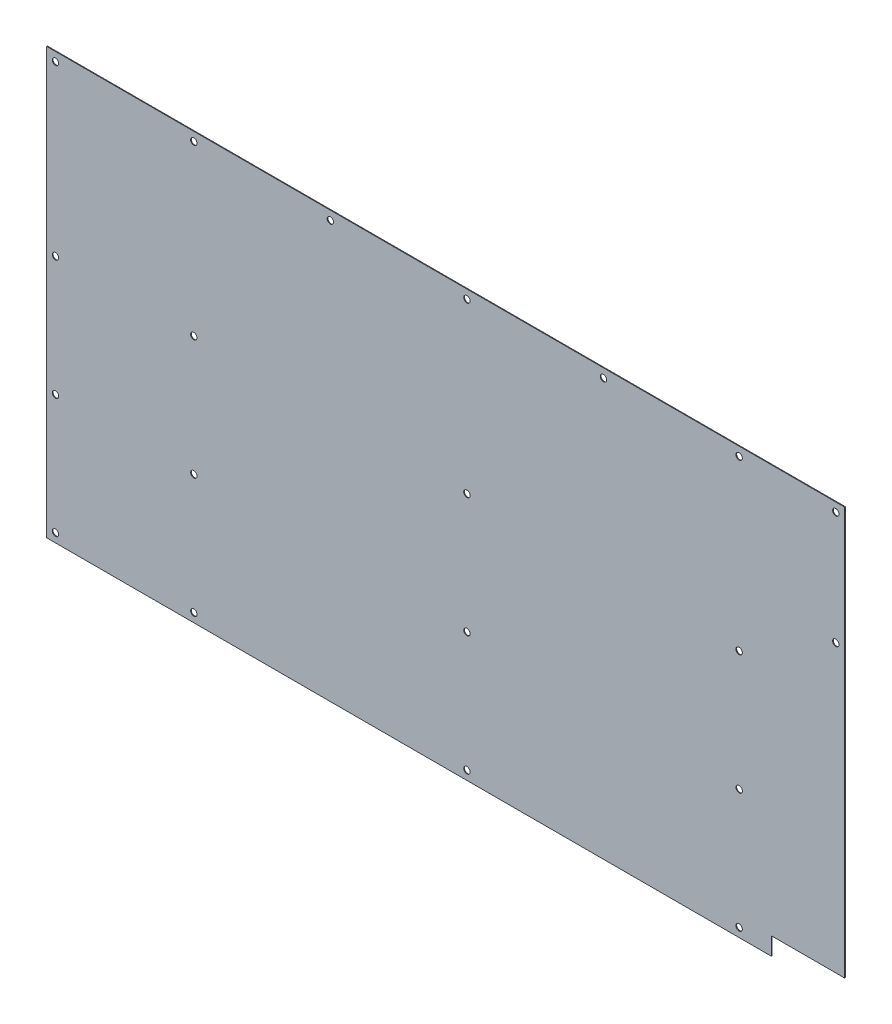
ISO-10303-21;
HEADER;
FILE_DESCRIPTION(('STEP AP214'),'2;1');
FILE_NAME('part.step','',(''),(''),'','','');
FILE_SCHEMA(('AUTOMOTIVE_DESIGN { 1 0 10303 214 1 1 1 1 }'));
ENDSEC;
DATA;
#1=APPLICATION_CONTEXT('core data for automotive mechanical design processes');
#2=APPLICATION_PROTOCOL_DEFINITION('international standard','automotive_design',2000,#1);
#3=PRODUCT_CONTEXT('',#1,'mechanical');
#4=PRODUCT('Part','Part','',(#3));
#5=PRODUCT_RELATED_PRODUCT_CATEGORY('part','',(#4));
#6=PRODUCT_DEFINITION_FORMATION('','',#4);
#7=PRODUCT_DEFINITION_CONTEXT('part definition',#1,'design');
#8=PRODUCT_DEFINITION('design','',#6,#7);
#9=PRODUCT_DEFINITION_SHAPE('','',#8);
#10=(LENGTH_UNIT() NAMED_UNIT(*) SI_UNIT(.MILLI.,.METRE.));
#11=(NAMED_UNIT(*) PLANE_ANGLE_UNIT() SI_UNIT($,.RADIAN.));
#12=(NAMED_UNIT(*) SI_UNIT($,.STERADIAN.) SOLID_ANGLE_UNIT());
#13=UNCERTAINTY_MEASURE_WITH_UNIT(LENGTH_MEASURE(1.E-05),#10,'distance_accuracy_value','');
#14=(GEOMETRIC_REPRESENTATION_CONTEXT(3) GLOBAL_UNCERTAINTY_ASSIGNED_CONTEXT((#13)) GLOBAL_UNIT_ASSIGNED_CONTEXT((#10,
#11,#12)) REPRESENTATION_CONTEXT('',''));
#15=CARTESIAN_POINT('',(0.,0.,0.));
#16=DIRECTION('',(0.,0.,1.));
#17=DIRECTION('',(1.,0.,0.));
#18=AXIS2_PLACEMENT_3D('',#15,#16,#17);
#19=CARTESIAN_POINT('',(0.,243.84,0.4064));
#20=DIRECTION('',(0.,0.,-1.));
#21=DIRECTION('',(-1.,0.,0.));
#22=AXIS2_PLACEMENT_3D('',#19,#20,#21);
#23=CYLINDRICAL_SURFACE('',#22,0.0635);
#24=CARTESIAN_POINT('',(0.,243.84,0.));
#25=DIRECTION('',(0.,0.,1.));
#26=DIRECTION('',(1.,0.,0.));
#27=AXIS2_PLACEMENT_3D('',#24,#25,#26);
#28=CIRCLE('',#27,0.0635);
#29=CARTESIAN_POINT('',(0.,243.7765,0.));
#30=VERTEX_POINT('',#29);
#31=CARTESIAN_POINT('',(0.0635,243.84,0.));
#32=VERTEX_POINT('',#31);
#33=EDGE_CURVE('E212',#30,#32,#28,.T.);
#34=ORIENTED_EDGE('',*,*,#33,.F.);
#35=DIRECTION('',(0.,0.,-1.));
#36=VECTOR('',#35,1.);
#37=CARTESIAN_POINT('',(0.,243.7765,0.4064));
#38=LINE('',#37,#36);
#39=CARTESIAN_POINT('',(0.,243.7765,0.4064));
#40=VERTEX_POINT('',#39);
#41=EDGE_CURVE('E11',#40,#30,#38,.T.);
#42=ORIENTED_EDGE('',*,*,#41,.F.);
#43=CARTESIAN_POINT('',(0.,243.84,0.4064));
#44=DIRECTION('',(0.,0.,1.));
#45=DIRECTION('',(1.,0.,0.));
#46=AXIS2_PLACEMENT_3D('',#43,#44,#45);
#47=CIRCLE('',#46,0.0635);
#48=CARTESIAN_POINT('',(0.0635,243.84,0.4064));
#49=VERTEX_POINT('',#48);
#50=EDGE_CURVE('E664',#40,#49,#47,.T.);
#51=ORIENTED_EDGE('',*,*,#50,.T.);
#52=DIRECTION('',(0.,0.,-1.));
#53=VECTOR('',#52,1.);
#54=CARTESIAN_POINT('',(0.0635,243.84,0.4064));
#55=LINE('',#54,#53);
#56=EDGE_CURVE('E99',#49,#32,#55,.T.);
#57=ORIENTED_EDGE('',*,*,#56,.T.);
#58=EDGE_LOOP('',(#34,#42,#51,#57));
#59=FACE_BOUND('',#58,.T.);
#60=ADVANCED_FACE('F39',(#59),#23,.F.);
#61=CARTESIAN_POINT('',(0.,0.,0.4064));
#62=DIRECTION('',(1.,0.,0.));
#63=DIRECTION('',(0.,0.,-1.));
#64=AXIS2_PLACEMENT_3D('',#61,#62,#63);
#65=PLANE('',#64);
#66=DIRECTION('',(0.,-1.,0.));
#67=VECTOR('',#66,1.);
#68=CARTESIAN_POINT('',(0.,0.,0.));
#69=LINE('',#68,#67);
#70=CARTESIAN_POINT('',(0.,0.,0.));
#71=VERTEX_POINT('',#70);
#72=EDGE_CURVE('E215',#30,#71,#69,.T.);
#73=ORIENTED_EDGE('',*,*,#72,.T.);
#74=DIRECTION('',(0.,0.,-1.));
#75=VECTOR('',#74,1.);
#76=CARTESIAN_POINT('',(0.,0.,0.4064));
#77=LINE('',#76,#75);
#78=CARTESIAN_POINT('',(0.,0.,0.4064));
#79=VERTEX_POINT('',#78);
#80=EDGE_CURVE('E48',#79,#71,#77,.T.);
#81=ORIENTED_EDGE('',*,*,#80,.F.);
#82=DIRECTION('',(0.,-1.,0.));
#83=VECTOR('',#82,1.);
#84=CARTESIAN_POINT('',(0.,0.,0.4064));
#85=LINE('',#84,#83);
#86=EDGE_CURVE('E656',#40,#79,#85,.T.);
#87=ORIENTED_EDGE('',*,*,#86,.F.);
#88=ORIENTED_EDGE('',*,*,#41,.T.);
#89=EDGE_LOOP('',(#73,#81,#87,#88));
#90=FACE_BOUND('',#89,.T.);
#91=ADVANCED_FACE('F266',(#90),#65,.F.);
#92=CARTESIAN_POINT('',(0.,0.,0.4064));
#93=DIRECTION('',(0.,1.,0.));
#94=DIRECTION('',(-1.,0.,0.));
#95=AXIS2_PLACEMENT_3D('',#92,#93,#94);
#96=PLANE('',#95);
#97=DIRECTION('',(1.,0.,0.));
#98=VECTOR('',#97,1.);
#99=CARTESIAN_POINT('',(0.,0.,0.));
#100=LINE('',#99,#98);
#101=CARTESIAN_POINT('',(415.2265,0.,0.));
#102=VERTEX_POINT('',#101);
#103=EDGE_CURVE('E218',#71,#102,#100,.T.);
#104=ORIENTED_EDGE('',*,*,#103,.T.);
#105=DIRECTION('',(0.,0.,-1.));
#106=VECTOR('',#105,1.);
#107=CARTESIAN_POINT('',(415.2265,0.,0.4064));
#108=LINE('',#107,#106);
#109=CARTESIAN_POINT('',(415.2265,0.,0.4064));
#110=VERTEX_POINT('',#109);
#111=EDGE_CURVE('E256',#110,#102,#108,.T.);
#112=ORIENTED_EDGE('',*,*,#111,.F.);
#113=DIRECTION('',(1.,0.,0.));
#114=VECTOR('',#113,1.);
#115=CARTESIAN_POINT('',(0.,0.,0.4064));
#116=LINE('',#115,#114);
#117=EDGE_CURVE('E262',#79,#110,#116,.T.);
#118=ORIENTED_EDGE('',*,*,#117,.F.);
#119=ORIENTED_EDGE('',*,*,#80,.T.);
#120=EDGE_LOOP('',(#104,#112,#118,#119));
#121=FACE_BOUND('',#120,.T.);
#122=ADVANCED_FACE('F260',(#121),#96,.F.);
#123=CARTESIAN_POINT('',(415.29,0.,0.4064));
#124=DIRECTION('',(0.,0.,-1.));
#125=DIRECTION('',(-1.,0.,0.));
#126=AXIS2_PLACEMENT_3D('',#123,#124,#125);
#127=CYLINDRICAL_SURFACE('',#126,0.0634999999999941);
#128=CARTESIAN_POINT('',(415.29,0.,0.));
#129=DIRECTION('',(0.,0.,1.));
#130=DIRECTION('',(1.,0.,0.));
#131=AXIS2_PLACEMENT_3D('',#128,#129,#130);
#132=CIRCLE('',#131,0.0634999999999941);
#133=CARTESIAN_POINT('',(415.29,0.0634999999999941,0.));
#134=VERTEX_POINT('',#133);
#135=EDGE_CURVE('E221',#134,#102,#132,.T.);
#136=ORIENTED_EDGE('',*,*,#135,.F.);
#137=DIRECTION('',(0.,0.,-1.));
#138=VECTOR('',#137,1.);
#139=CARTESIAN_POINT('',(415.29,0.0634999999999941,0.4064));
#140=LINE('',#139,#138);
#141=CARTESIAN_POINT('',(415.29,0.0634999999999941,0.4064));
#142=VERTEX_POINT('',#141);
#143=EDGE_CURVE('E254',#142,#134,#140,.T.);
#144=ORIENTED_EDGE('',*,*,#143,.F.);
#145=CARTESIAN_POINT('',(415.29,0.,0.4064));
#146=DIRECTION('',(0.,0.,1.));
#147=DIRECTION('',(1.,0.,0.));
#148=AXIS2_PLACEMENT_3D('',#145,#146,#147);
#149=CIRCLE('',#148,0.0634999999999941);
#150=EDGE_CURVE('E653',#142,#110,#149,.T.);
#151=ORIENTED_EDGE('',*,*,#150,.T.);
#152=ORIENTED_EDGE('',*,*,#111,.T.);
#153=EDGE_LOOP('',(#136,#144,#151,#152));
#154=FACE_BOUND('',#153,.T.);
#155=ADVANCED_FACE('F444',(#154),#127,.F.);
#156=CARTESIAN_POINT('',(415.29,0.,0.4064));
#157=DIRECTION('',(-1.,0.,0.));
#158=DIRECTION('',(0.,0.,1.));
#159=AXIS2_PLACEMENT_3D('',#156,#157,#158);
#160=PLANE('',#159);
#161=DIRECTION('',(0.,1.,0.));
#162=VECTOR('',#161,1.);
#163=CARTESIAN_POINT('',(415.29,0.,0.));
#164=LINE('',#163,#162);
#165=CARTESIAN_POINT('',(415.29,10.0965,0.));
#166=VERTEX_POINT('',#165);
#167=EDGE_CURVE('E224',#134,#166,#164,.T.);
#168=ORIENTED_EDGE('',*,*,#167,.T.);
#169=DIRECTION('',(0.,0.,-1.));
#170=VECTOR('',#169,1.);
#171=CARTESIAN_POINT('',(415.29,10.0965,0.4064));
#172=LINE('',#171,#170);
#173=CARTESIAN_POINT('',(415.29,10.0965,0.4064));
#174=VERTEX_POINT('',#173);
#175=EDGE_CURVE('E252',#174,#166,#172,.T.);
#176=ORIENTED_EDGE('',*,*,#175,.F.);
#177=DIRECTION('',(0.,1.,0.));
#178=VECTOR('',#177,1.);
#179=CARTESIAN_POINT('',(415.29,0.,0.4064));
#180=LINE('',#179,#178);
#181=EDGE_CURVE('E649',#142,#174,#180,.T.);
#182=ORIENTED_EDGE('',*,*,#181,.F.);
#183=ORIENTED_EDGE('',*,*,#143,.T.);
#184=EDGE_LOOP('',(#168,#176,#182,#183));
#185=FACE_BOUND('',#184,.T.);
#186=ADVANCED_FACE('F440',(#185),#160,.F.);
#187=CARTESIAN_POINT('',(415.29,10.16,0.4064));
#188=DIRECTION('',(0.,0.,-1.));
#189=DIRECTION('',(-1.,0.,0.));
#190=AXIS2_PLACEMENT_3D('',#187,#188,#189);
#191=CYLINDRICAL_SURFACE('',#190,0.0634999999999941);
#192=CARTESIAN_POINT('',(415.29,10.16,0.));
#193=DIRECTION('',(0.,0.,1.));
#194=DIRECTION('',(1.,0.,0.));
#195=AXIS2_PLACEMENT_3D('',#192,#193,#194);
#196=CIRCLE('',#195,0.0634999999999941);
#197=CARTESIAN_POINT('',(415.3535,10.16,0.));
#198=VERTEX_POINT('',#197);
#199=EDGE_CURVE('E227',#198,#166,#196,.T.);
#200=ORIENTED_EDGE('',*,*,#199,.F.);
#201=DIRECTION('',(0.,0.,-1.));
#202=VECTOR('',#201,1.);
#203=CARTESIAN_POINT('',(415.3535,10.16,0.4064));
#204=LINE('',#203,#202);
#205=CARTESIAN_POINT('',(415.3535,10.16,0.4064));
#206=VERTEX_POINT('',#205);
#207=EDGE_CURVE('E250',#206,#198,#204,.T.);
#208=ORIENTED_EDGE('',*,*,#207,.F.);
#209=CARTESIAN_POINT('',(415.29,10.16,0.4064));
#210=DIRECTION('',(0.,0.,1.));
#211=DIRECTION('',(1.,0.,0.));
#212=AXIS2_PLACEMENT_3D('',#209,#210,#211);
#213=CIRCLE('',#212,0.0634999999999941);
#214=EDGE_CURVE('E652',#206,#174,#213,.T.);
#215=ORIENTED_EDGE('',*,*,#214,.T.);
#216=ORIENTED_EDGE('',*,*,#175,.T.);
#217=EDGE_LOOP('',(#200,#208,#215,#216));
#218=FACE_BOUND('',#217,.T.);
#219=ADVANCED_FACE('F436',(#218),#191,.F.);
#220=CARTESIAN_POINT('',(0.,10.16,0.4064));
#221=DIRECTION('',(0.,1.,0.));
#222=DIRECTION('',(0.,0.,1.));
#223=AXIS2_PLACEMENT_3D('',#220,#221,#222);
#224=PLANE('',#223);
#225=DIRECTION('',(1.,0.,0.));
#226=VECTOR('',#225,1.);
#227=CARTESIAN_POINT('',(0.,10.16,0.));
#228=LINE('',#227,#226);
#229=CARTESIAN_POINT('',(457.1365,10.16,0.));
#230=VERTEX_POINT('',#229);
#231=EDGE_CURVE('E230',#198,#230,#228,.T.);
#232=ORIENTED_EDGE('',*,*,#231,.T.);
#233=DIRECTION('',(0.,0.,-1.));
#234=VECTOR('',#233,1.);
#235=CARTESIAN_POINT('',(457.1365,10.16,0.4064));
#236=LINE('',#235,#234);
#237=CARTESIAN_POINT('',(457.1365,10.16,0.4064));
#238=VERTEX_POINT('',#237);
#239=EDGE_CURVE('E248',#238,#230,#236,.T.);
#240=ORIENTED_EDGE('',*,*,#239,.F.);
#241=DIRECTION('',(1.,0.,0.));
#242=VECTOR('',#241,1.);
#243=CARTESIAN_POINT('',(0.,10.16,0.4064));
#244=LINE('',#243,#242);
#245=EDGE_CURVE('E661',#206,#238,#244,.T.);
#246=ORIENTED_EDGE('',*,*,#245,.F.);
#247=ORIENTED_EDGE('',*,*,#207,.T.);
#248=EDGE_LOOP('',(#232,#240,#246,#247));
#249=FACE_BOUND('',#248,.T.);
#250=ADVANCED_FACE('F432',(#249),#224,.F.);
#251=CARTESIAN_POINT('',(457.2,10.16,0.4064));
#252=DIRECTION('',(0.,0.,-1.));
#253=DIRECTION('',(-1.,0.,0.));
#254=AXIS2_PLACEMENT_3D('',#251,#252,#253);
#255=CYLINDRICAL_SURFACE('',#254,0.0634999999999941);
#256=CARTESIAN_POINT('',(457.2,10.16,0.));
#257=DIRECTION('',(0.,0.,1.));
#258=DIRECTION('',(1.,0.,0.));
#259=AXIS2_PLACEMENT_3D('',#256,#257,#258);
#260=CIRCLE('',#259,0.0634999999999941);
#261=CARTESIAN_POINT('',(457.2,10.2235,0.));
#262=VERTEX_POINT('',#261);
#263=EDGE_CURVE('E233',#262,#230,#260,.T.);
#264=ORIENTED_EDGE('',*,*,#263,.F.);
#265=DIRECTION('',(0.,0.,-1.));
#266=VECTOR('',#265,1.);
#267=CARTESIAN_POINT('',(457.2,10.2235,0.4064));
#268=LINE('',#267,#266);
#269=CARTESIAN_POINT('',(457.2,10.2235,0.4064));
#270=VERTEX_POINT('',#269);
#271=EDGE_CURVE('E145',#270,#262,#268,.T.);
#272=ORIENTED_EDGE('',*,*,#271,.F.);
#273=CARTESIAN_POINT('',(457.2,10.16,0.4064));
#274=DIRECTION('',(0.,0.,1.));
#275=DIRECTION('',(1.,0.,0.));
#276=AXIS2_PLACEMENT_3D('',#273,#274,#275);
#277=CIRCLE('',#276,0.0634999999999941);
#278=EDGE_CURVE('E134',#270,#238,#277,.T.);
#279=ORIENTED_EDGE('',*,*,#278,.T.);
#280=ORIENTED_EDGE('',*,*,#239,.T.);
#281=EDGE_LOOP('',(#264,#272,#279,#280));
#282=FACE_BOUND('',#281,.T.);
#283=ADVANCED_FACE('F429',(#282),#255,.F.);
#284=CARTESIAN_POINT('',(457.2,0.,0.4064));
#285=DIRECTION('',(-1.,0.,0.));
#286=DIRECTION('',(0.,0.,1.));
#287=AXIS2_PLACEMENT_3D('',#284,#285,#286);
#288=PLANE('',#287);
#289=DIRECTION('',(0.,1.,0.));
#290=VECTOR('',#289,1.);
#291=CARTESIAN_POINT('',(457.2,0.,0.));
#292=LINE('',#291,#290);
#293=CARTESIAN_POINT('',(457.2,243.7765,0.));
#294=VERTEX_POINT('',#293);
#295=EDGE_CURVE('E141',#262,#294,#292,.T.);
#296=ORIENTED_EDGE('',*,*,#295,.T.);
#297=DIRECTION('',(0.,0.,-1.));
#298=VECTOR('',#297,1.);
#299=CARTESIAN_POINT('',(457.2,243.7765,0.4064));
#300=LINE('',#299,#298);
#301=CARTESIAN_POINT('',(457.2,243.7765,0.4064));
#302=VERTEX_POINT('',#301);
#303=EDGE_CURVE('E138',#302,#294,#300,.T.);
#304=ORIENTED_EDGE('',*,*,#303,.F.);
#305=DIRECTION('',(0.,1.,0.));
#306=VECTOR('',#305,1.);
#307=CARTESIAN_POINT('',(457.2,0.,0.4064));
#308=LINE('',#307,#306);
#309=EDGE_CURVE('E127',#270,#302,#308,.T.);
#310=ORIENTED_EDGE('',*,*,#309,.F.);
#311=ORIENTED_EDGE('',*,*,#271,.T.);
#312=EDGE_LOOP('',(#296,#304,#310,#311));
#313=FACE_BOUND('',#312,.T.);
#314=ADVANCED_FACE('F139',(#313),#288,.F.);
#315=CARTESIAN_POINT('',(457.2,243.84,0.4064));
#316=DIRECTION('',(0.,0.,-1.));
#317=DIRECTION('',(-1.,0.,0.));
#318=AXIS2_PLACEMENT_3D('',#315,#316,#317);
#319=CYLINDRICAL_SURFACE('',#318,0.0634999999999941);
#320=CARTESIAN_POINT('',(457.2,243.84,0.));
#321=DIRECTION('',(0.,0.,1.));
#322=DIRECTION('',(1.,0.,0.));
#323=AXIS2_PLACEMENT_3D('',#320,#321,#322);
#324=CIRCLE('',#323,0.0634999999999941);
#325=CARTESIAN_POINT('',(457.1365,243.84,0.));
#326=VERTEX_POINT('',#325);
#327=EDGE_CURVE('E237',#326,#294,#324,.T.);
#328=ORIENTED_EDGE('',*,*,#327,.F.);
#329=DIRECTION('',(0.,0.,-1.));
#330=VECTOR('',#329,1.);
#331=CARTESIAN_POINT('',(457.1365,243.84,0.4064));
#332=LINE('',#331,#330);
#333=CARTESIAN_POINT('',(457.1365,243.84,0.4064));
#334=VERTEX_POINT('',#333);
#335=EDGE_CURVE('E92',#334,#326,#332,.T.);
#336=ORIENTED_EDGE('',*,*,#335,.F.);
#337=CARTESIAN_POINT('',(457.2,243.84,0.4064));
#338=DIRECTION('',(0.,0.,1.));
#339=DIRECTION('',(1.,0.,0.));
#340=AXIS2_PLACEMENT_3D('',#337,#338,#339);
#341=CIRCLE('',#340,0.0634999999999941);
#342=EDGE_CURVE('E132',#334,#302,#341,.T.);
#343=ORIENTED_EDGE('',*,*,#342,.T.);
#344=ORIENTED_EDGE('',*,*,#303,.T.);
#345=EDGE_LOOP('',(#328,#336,#343,#344));
#346=FACE_BOUND('',#345,.T.);
#347=ADVANCED_FACE('F147',(#346),#319,.F.);
#348=CARTESIAN_POINT('',(0.,243.84,0.4064));
#349=DIRECTION('',(0.,-1.,0.));
#350=DIRECTION('',(0.,0.,-1.));
#351=AXIS2_PLACEMENT_3D('',#348,#349,#350);
#352=PLANE('',#351);
#353=DIRECTION('',(-1.,0.,0.));
#354=VECTOR('',#353,1.);
#355=CARTESIAN_POINT('',(0.,243.84,0.));
#356=LINE('',#355,#354);
#357=EDGE_CURVE('E239',#326,#32,#356,.T.);
#358=ORIENTED_EDGE('',*,*,#357,.T.);
#359=ORIENTED_EDGE('',*,*,#56,.F.);
#360=DIRECTION('',(-1.,0.,0.));
#361=VECTOR('',#360,1.);
#362=CARTESIAN_POINT('',(0.,243.84,0.4064));
#363=LINE('',#362,#361);
#364=EDGE_CURVE('E56',#334,#49,#363,.T.);
#365=ORIENTED_EDGE('',*,*,#364,.F.);
#366=ORIENTED_EDGE('',*,*,#335,.T.);
#367=EDGE_LOOP('',(#358,#359,#365,#366));
#368=FACE_BOUND('',#367,.T.);
#369=ADVANCED_FACE('F282',(#368),#352,.F.);
#370=CARTESIAN_POINT('',(5.08,73.66,0.4064));
#371=DIRECTION('',(0.,0.,-1.));
#372=DIRECTION('',(-1.,0.,0.));
#373=AXIS2_PLACEMENT_3D('',#370,#371,#372);
#374=CYLINDRICAL_SURFACE('',#373,1.8288);
#375=CARTESIAN_POINT('',(5.08,73.66,0.4064));
#376=DIRECTION('',(0.,0.,1.));
#377=DIRECTION('',(1.,0.,0.));
#378=AXIS2_PLACEMENT_3D('',#375,#376,#377);
#379=CIRCLE('',#378,1.8288);
#380=CARTESIAN_POINT('',(6.9088,73.66,0.4064));
#381=VERTEX_POINT('',#380);
#382=EDGE_CURVE('E665',#381,#381,#379,.T.);
#383=ORIENTED_EDGE('',*,*,#382,.T.);
#384=EDGE_LOOP('',(#383));
#385=FACE_BOUND('',#384,.T.);
#386=CARTESIAN_POINT('',(5.08,73.66,0.));
#387=DIRECTION('',(0.,0.,1.));
#388=DIRECTION('',(1.,0.,0.));
#389=AXIS2_PLACEMENT_3D('',#386,#387,#388);
#390=CIRCLE('',#389,1.8288);
#391=CARTESIAN_POINT('',(6.9088,73.66,0.));
#392=VERTEX_POINT('',#391);
#393=EDGE_CURVE('E209',#392,#392,#390,.T.);
#394=ORIENTED_EDGE('',*,*,#393,.F.);
#395=EDGE_LOOP('',(#394));
#396=FACE_BOUND('',#395,.T.);
#397=ADVANCED_FACE('F278',(#385,#396),#374,.F.);
#398=CARTESIAN_POINT('',(5.08,5.08,0.4064));
#399=DIRECTION('',(0.,0.,-1.));
#400=DIRECTION('',(-1.,0.,0.));
#401=AXIS2_PLACEMENT_3D('',#398,#399,#400);
#402=CYLINDRICAL_SURFACE('',#401,1.8288);
#403=CARTESIAN_POINT('',(5.08,5.08,0.4064));
#404=DIRECTION('',(0.,0.,1.));
#405=DIRECTION('',(1.,0.,0.));
#406=AXIS2_PLACEMENT_3D('',#403,#404,#405);
#407=CIRCLE('',#406,1.8288);
#408=CARTESIAN_POINT('',(6.9088,5.08,0.4064));
#409=VERTEX_POINT('',#408);
#410=EDGE_CURVE('E668',#409,#409,#407,.T.);
#411=ORIENTED_EDGE('',*,*,#410,.T.);
#412=EDGE_LOOP('',(#411));
#413=FACE_BOUND('',#412,.T.);
#414=CARTESIAN_POINT('',(5.08,5.08,0.));
#415=DIRECTION('',(0.,0.,1.));
#416=DIRECTION('',(1.,0.,0.));
#417=AXIS2_PLACEMENT_3D('',#414,#415,#416);
#418=CIRCLE('',#417,1.8288);
#419=CARTESIAN_POINT('',(6.9088,5.08,0.));
#420=VERTEX_POINT('',#419);
#421=EDGE_CURVE('E206',#420,#420,#418,.T.);
#422=ORIENTED_EDGE('',*,*,#421,.F.);
#423=EDGE_LOOP('',(#422));
#424=FACE_BOUND('',#423,.T.);
#425=ADVANCED_FACE('F281',(#413,#424),#402,.F.);
#426=CARTESIAN_POINT('',(5.08,238.76,0.4064));
#427=DIRECTION('',(0.,0.,-1.));
#428=DIRECTION('',(-1.,0.,0.));
#429=AXIS2_PLACEMENT_3D('',#426,#427,#428);
#430=CYLINDRICAL_SURFACE('',#429,1.8288);
#431=CARTESIAN_POINT('',(5.08,238.76,0.4064));
#432=DIRECTION('',(0.,0.,1.));
#433=DIRECTION('',(1.,0.,0.));
#434=AXIS2_PLACEMENT_3D('',#431,#432,#433);
#435=CIRCLE('',#434,1.8288);
#436=CARTESIAN_POINT('',(6.9088,238.76,0.4064));
#437=VERTEX_POINT('',#436);
#438=EDGE_CURVE('E673',#437,#437,#435,.T.);
#439=ORIENTED_EDGE('',*,*,#438,.T.);
#440=EDGE_LOOP('',(#439));
#441=FACE_BOUND('',#440,.T.);
#442=CARTESIAN_POINT('',(5.08,238.76,0.));
#443=DIRECTION('',(0.,0.,1.));
#444=DIRECTION('',(1.,0.,0.));
#445=AXIS2_PLACEMENT_3D('',#442,#443,#444);
#446=CIRCLE('',#445,1.8288);
#447=CARTESIAN_POINT('',(6.9088,238.76,0.));
#448=VERTEX_POINT('',#447);
#449=EDGE_CURVE('E203',#448,#448,#446,.T.);
#450=ORIENTED_EDGE('',*,*,#449,.F.);
#451=EDGE_LOOP('',(#450));
#452=FACE_BOUND('',#451,.T.);
#453=ADVANCED_FACE('F286',(#441,#452),#430,.F.);
#454=CARTESIAN_POINT('',(84.328,238.76,0.4064));
#455=DIRECTION('',(0.,0.,-1.));
#456=DIRECTION('',(-1.,0.,0.));
#457=AXIS2_PLACEMENT_3D('',#454,#455,#456);
#458=CYLINDRICAL_SURFACE('',#457,1.8288);
#459=CARTESIAN_POINT('',(84.328,238.76,0.4064));
#460=DIRECTION('',(0.,0.,1.));
#461=DIRECTION('',(1.,0.,0.));
#462=AXIS2_PLACEMENT_3D('',#459,#460,#461);
#463=CIRCLE('',#462,1.8288);
#464=CARTESIAN_POINT('',(86.1568,238.76,0.4064));
#465=VERTEX_POINT('',#464);
#466=EDGE_CURVE('E676',#465,#465,#463,.T.);
#467=ORIENTED_EDGE('',*,*,#466,.T.);
#468=EDGE_LOOP('',(#467));
#469=FACE_BOUND('',#468,.T.);
#470=CARTESIAN_POINT('',(84.328,238.76,0.));
#471=DIRECTION('',(0.,0.,1.));
#472=DIRECTION('',(1.,0.,0.));
#473=AXIS2_PLACEMENT_3D('',#470,#471,#472);
#474=CIRCLE('',#473,1.8288);
#475=CARTESIAN_POINT('',(86.1568,238.76,0.));
#476=VERTEX_POINT('',#475);
#477=EDGE_CURVE('E200',#476,#476,#474,.T.);
#478=ORIENTED_EDGE('',*,*,#477,.F.);
#479=EDGE_LOOP('',(#478));
#480=FACE_BOUND('',#479,.T.);
#481=ADVANCED_FACE('F290',(#469,#480),#458,.F.);
#482=CARTESIAN_POINT('',(162.56,238.76,0.4064));
#483=DIRECTION('',(0.,0.,-1.));
#484=DIRECTION('',(-1.,0.,0.));
#485=AXIS2_PLACEMENT_3D('',#482,#483,#484);
#486=CYLINDRICAL_SURFACE('',#485,1.82879999999998);
#487=CARTESIAN_POINT('',(162.56,238.76,0.4064));
#488=DIRECTION('',(0.,0.,1.));
#489=DIRECTION('',(1.,0.,0.));
#490=AXIS2_PLACEMENT_3D('',#487,#488,#489);
#491=CIRCLE('',#490,1.82879999999998);
#492=CARTESIAN_POINT('',(164.3888,238.76,0.4064));
#493=VERTEX_POINT('',#492);
#494=EDGE_CURVE('E679',#493,#493,#491,.T.);
#495=ORIENTED_EDGE('',*,*,#494,.T.);
#496=EDGE_LOOP('',(#495));
#497=FACE_BOUND('',#496,.T.);
#498=CARTESIAN_POINT('',(162.56,238.76,0.));
#499=DIRECTION('',(0.,0.,1.));
#500=DIRECTION('',(1.,0.,0.));
#501=AXIS2_PLACEMENT_3D('',#498,#499,#500);
#502=CIRCLE('',#501,1.82879999999998);
#503=CARTESIAN_POINT('',(164.3888,238.76,0.));
#504=VERTEX_POINT('',#503);
#505=EDGE_CURVE('E197',#504,#504,#502,.T.);
#506=ORIENTED_EDGE('',*,*,#505,.F.);
#507=EDGE_LOOP('',(#506));
#508=FACE_BOUND('',#507,.T.);
#509=ADVANCED_FACE('F294',(#497,#508),#486,.F.);
#510=CARTESIAN_POINT('',(240.792,238.76,0.4064));
#511=DIRECTION('',(0.,0.,-1.));
#512=DIRECTION('',(-1.,0.,0.));
#513=AXIS2_PLACEMENT_3D('',#510,#511,#512);
#514=CYLINDRICAL_SURFACE('',#513,1.82879999999998);
#515=CARTESIAN_POINT('',(240.792,238.76,0.4064));
#516=DIRECTION('',(0.,0.,1.));
#517=DIRECTION('',(1.,0.,0.));
#518=AXIS2_PLACEMENT_3D('',#515,#516,#517);
#519=CIRCLE('',#518,1.82879999999998);
#520=CARTESIAN_POINT('',(242.6208,238.76,0.4064));
#521=VERTEX_POINT('',#520);
#522=EDGE_CURVE('E682',#521,#521,#519,.T.);
#523=ORIENTED_EDGE('',*,*,#522,.T.);
#524=EDGE_LOOP('',(#523));
#525=FACE_BOUND('',#524,.T.);
#526=CARTESIAN_POINT('',(240.792,238.76,0.));
#527=DIRECTION('',(0.,0.,1.));
#528=DIRECTION('',(1.,0.,0.));
#529=AXIS2_PLACEMENT_3D('',#526,#527,#528);
#530=CIRCLE('',#529,1.82879999999998);
#531=CARTESIAN_POINT('',(242.6208,238.76,0.));
#532=VERTEX_POINT('',#531);
#533=EDGE_CURVE('E194',#532,#532,#530,.T.);
#534=ORIENTED_EDGE('',*,*,#533,.F.);
#535=EDGE_LOOP('',(#534));
#536=FACE_BOUND('',#535,.T.);
#537=ADVANCED_FACE('F298',(#525,#536),#514,.F.);
#538=CARTESIAN_POINT('',(319.024,238.76,0.4064));
#539=DIRECTION('',(0.,0.,-1.));
#540=DIRECTION('',(-1.,0.,0.));
#541=AXIS2_PLACEMENT_3D('',#538,#539,#540);
#542=CYLINDRICAL_SURFACE('',#541,1.82880000000004);
#543=CARTESIAN_POINT('',(319.024,238.76,0.4064));
#544=DIRECTION('',(0.,0.,1.));
#545=DIRECTION('',(1.,0.,0.));
#546=AXIS2_PLACEMENT_3D('',#543,#544,#545);
#547=CIRCLE('',#546,1.82880000000004);
#548=CARTESIAN_POINT('',(320.8528,238.76,0.4064));
#549=VERTEX_POINT('',#548);
#550=EDGE_CURVE('E685',#549,#549,#547,.T.);
#551=ORIENTED_EDGE('',*,*,#550,.T.);
#552=EDGE_LOOP('',(#551));
#553=FACE_BOUND('',#552,.T.);
#554=CARTESIAN_POINT('',(319.024,238.76,0.));
#555=DIRECTION('',(0.,0.,1.));
#556=DIRECTION('',(1.,0.,0.));
#557=AXIS2_PLACEMENT_3D('',#554,#555,#556);
#558=CIRCLE('',#557,1.82880000000004);
#559=CARTESIAN_POINT('',(320.8528,238.76,0.));
#560=VERTEX_POINT('',#559);
#561=EDGE_CURVE('E191',#560,#560,#558,.T.);
#562=ORIENTED_EDGE('',*,*,#561,.F.);
#563=EDGE_LOOP('',(#562));
#564=FACE_BOUND('',#563,.T.);
#565=ADVANCED_FACE('F302',(#553,#564),#542,.F.);
#566=CARTESIAN_POINT('',(396.748,238.76,0.4064));
#567=DIRECTION('',(0.,0.,-1.));
#568=DIRECTION('',(-1.,0.,0.));
#569=AXIS2_PLACEMENT_3D('',#566,#567,#568);
#570=CYLINDRICAL_SURFACE('',#569,1.82880000000004);
#571=CARTESIAN_POINT('',(396.748,238.76,0.4064));
#572=DIRECTION('',(0.,0.,1.));
#573=DIRECTION('',(1.,0.,0.));
#574=AXIS2_PLACEMENT_3D('',#571,#572,#573);
#575=CIRCLE('',#574,1.82880000000004);
#576=CARTESIAN_POINT('',(398.5768,238.76,0.4064));
#577=VERTEX_POINT('',#576);
#578=EDGE_CURVE('E688',#577,#577,#575,.T.);
#579=ORIENTED_EDGE('',*,*,#578,.T.);
#580=EDGE_LOOP('',(#579));
#581=FACE_BOUND('',#580,.T.);
#582=CARTESIAN_POINT('',(396.748,238.76,0.));
#583=DIRECTION('',(0.,0.,1.));
#584=DIRECTION('',(1.,0.,0.));
#585=AXIS2_PLACEMENT_3D('',#582,#583,#584);
#586=CIRCLE('',#585,1.82880000000004);
#587=CARTESIAN_POINT('',(398.5768,238.76,0.));
#588=VERTEX_POINT('',#587);
#589=EDGE_CURVE('E188',#588,#588,#586,.T.);
#590=ORIENTED_EDGE('',*,*,#589,.F.);
#591=EDGE_LOOP('',(#590));
#592=FACE_BOUND('',#591,.T.);
#593=ADVANCED_FACE('F306',(#581,#592),#570,.F.);
#594=CARTESIAN_POINT('',(452.12,238.76,0.4064));
#595=DIRECTION('',(0.,0.,-1.));
#596=DIRECTION('',(-1.,0.,0.));
#597=AXIS2_PLACEMENT_3D('',#594,#595,#596);
#598=CYLINDRICAL_SURFACE('',#597,1.82880000000004);
#599=CARTESIAN_POINT('',(452.12,238.76,0.4064));
#600=DIRECTION('',(0.,0.,1.));
#601=DIRECTION('',(1.,0.,0.));
#602=AXIS2_PLACEMENT_3D('',#599,#600,#601);
#603=CIRCLE('',#602,1.82880000000004);
#604=CARTESIAN_POINT('',(453.9488,238.76,0.4064));
#605=VERTEX_POINT('',#604);
#606=EDGE_CURVE('E691',#605,#605,#603,.T.);
#607=ORIENTED_EDGE('',*,*,#606,.T.);
#608=EDGE_LOOP('',(#607));
#609=FACE_BOUND('',#608,.T.);
#610=CARTESIAN_POINT('',(452.12,238.76,0.));
#611=DIRECTION('',(0.,0.,1.));
#612=DIRECTION('',(1.,0.,0.));
#613=AXIS2_PLACEMENT_3D('',#610,#611,#612);
#614=CIRCLE('',#613,1.82880000000004);
#615=CARTESIAN_POINT('',(453.9488,238.76,0.));
#616=VERTEX_POINT('',#615);
#617=EDGE_CURVE('E185',#616,#616,#614,.T.);
#618=ORIENTED_EDGE('',*,*,#617,.F.);
#619=EDGE_LOOP('',(#618));
#620=FACE_BOUND('',#619,.T.);
#621=ADVANCED_FACE('F310',(#609,#620),#598,.F.);
#622=CARTESIAN_POINT('',(452.12,173.99,0.4064));
#623=DIRECTION('',(0.,0.,-1.));
#624=DIRECTION('',(-1.,0.,0.));
#625=AXIS2_PLACEMENT_3D('',#622,#623,#624);
#626=CYLINDRICAL_SURFACE('',#625,1.82880000000004);
#627=CARTESIAN_POINT('',(452.12,173.99,0.4064));
#628=DIRECTION('',(0.,0.,1.));
#629=DIRECTION('',(1.,0.,0.));
#630=AXIS2_PLACEMENT_3D('',#627,#628,#629);
#631=CIRCLE('',#630,1.82880000000004);
#632=CARTESIAN_POINT('',(453.9488,173.99,0.4064));
#633=VERTEX_POINT('',#632);
#634=EDGE_CURVE('E694',#633,#633,#631,.T.);
#635=ORIENTED_EDGE('',*,*,#634,.T.);
#636=EDGE_LOOP('',(#635));
#637=FACE_BOUND('',#636,.T.);
#638=CARTESIAN_POINT('',(452.12,173.99,0.));
#639=DIRECTION('',(0.,0.,1.));
#640=DIRECTION('',(1.,0.,0.));
#641=AXIS2_PLACEMENT_3D('',#638,#639,#640);
#642=CIRCLE('',#641,1.82880000000004);
#643=CARTESIAN_POINT('',(453.9488,173.99,0.));
#644=VERTEX_POINT('',#643);
#645=EDGE_CURVE('E182',#644,#644,#642,.T.);
#646=ORIENTED_EDGE('',*,*,#645,.F.);
#647=EDGE_LOOP('',(#646));
#648=FACE_BOUND('',#647,.T.);
#649=ADVANCED_FACE('F314',(#637,#648),#626,.F.);
#650=CARTESIAN_POINT('',(396.748,142.24,0.4064));
#651=DIRECTION('',(0.,0.,-1.));
#652=DIRECTION('',(-1.,0.,0.));
#653=AXIS2_PLACEMENT_3D('',#650,#651,#652);
#654=CYLINDRICAL_SURFACE('',#653,1.82880000000004);
#655=CARTESIAN_POINT('',(396.748,142.24,0.4064));
#656=DIRECTION('',(0.,0.,1.));
#657=DIRECTION('',(1.,0.,0.));
#658=AXIS2_PLACEMENT_3D('',#655,#656,#657);
#659=CIRCLE('',#658,1.82880000000004);
#660=CARTESIAN_POINT('',(398.5768,142.24,0.4064));
#661=VERTEX_POINT('',#660);
#662=EDGE_CURVE('E697',#661,#661,#659,.T.);
#663=ORIENTED_EDGE('',*,*,#662,.T.);
#664=EDGE_LOOP('',(#663));
#665=FACE_BOUND('',#664,.T.);
#666=CARTESIAN_POINT('',(396.748,142.24,0.));
#667=DIRECTION('',(0.,0.,1.));
#668=DIRECTION('',(1.,0.,0.));
#669=AXIS2_PLACEMENT_3D('',#666,#667,#668);
#670=CIRCLE('',#669,1.82880000000004);
#671=CARTESIAN_POINT('',(398.5768,142.24,0.));
#672=VERTEX_POINT('',#671);
#673=EDGE_CURVE('E179',#672,#672,#670,.T.);
#674=ORIENTED_EDGE('',*,*,#673,.F.);
#675=EDGE_LOOP('',(#674));
#676=FACE_BOUND('',#675,.T.);
#677=ADVANCED_FACE('F318',(#665,#676),#654,.F.);
#678=CARTESIAN_POINT('',(240.792,142.24,0.4064));
#679=DIRECTION('',(0.,0.,-1.));
#680=DIRECTION('',(-1.,0.,0.));
#681=AXIS2_PLACEMENT_3D('',#678,#679,#680);
#682=CYLINDRICAL_SURFACE('',#681,1.82879999999998);
#683=CARTESIAN_POINT('',(240.792,142.24,0.4064));
#684=DIRECTION('',(0.,0.,1.));
#685=DIRECTION('',(1.,0.,0.));
#686=AXIS2_PLACEMENT_3D('',#683,#684,#685);
#687=CIRCLE('',#686,1.82879999999998);
#688=CARTESIAN_POINT('',(242.6208,142.24,0.4064));
#689=VERTEX_POINT('',#688);
#690=EDGE_CURVE('E700',#689,#689,#687,.T.);
#691=ORIENTED_EDGE('',*,*,#690,.T.);
#692=EDGE_LOOP('',(#691));
#693=FACE_BOUND('',#692,.T.);
#694=CARTESIAN_POINT('',(240.792,142.24,0.));
#695=DIRECTION('',(0.,0.,1.));
#696=DIRECTION('',(1.,0.,0.));
#697=AXIS2_PLACEMENT_3D('',#694,#695,#696);
#698=CIRCLE('',#697,1.82879999999998);
#699=CARTESIAN_POINT('',(242.6208,142.24,0.));
#700=VERTEX_POINT('',#699);
#701=EDGE_CURVE('E176',#700,#700,#698,.T.);
#702=ORIENTED_EDGE('',*,*,#701,.F.);
#703=EDGE_LOOP('',(#702));
#704=FACE_BOUND('',#703,.T.);
#705=ADVANCED_FACE('F322',(#693,#704),#682,.F.);
#706=CARTESIAN_POINT('',(84.328,142.24,0.4064));
#707=DIRECTION('',(0.,0.,-1.));
#708=DIRECTION('',(-1.,0.,0.));
#709=AXIS2_PLACEMENT_3D('',#706,#707,#708);
#710=CYLINDRICAL_SURFACE('',#709,1.8288);
#711=CARTESIAN_POINT('',(84.328,142.24,0.4064));
#712=DIRECTION('',(0.,0.,1.));
#713=DIRECTION('',(1.,0.,0.));
#714=AXIS2_PLACEMENT_3D('',#711,#712,#713);
#715=CIRCLE('',#714,1.8288);
#716=CARTESIAN_POINT('',(86.1568,142.24,0.4064));
#717=VERTEX_POINT('',#716);
#718=EDGE_CURVE('E703',#717,#717,#715,.T.);
#719=ORIENTED_EDGE('',*,*,#718,.T.);
#720=EDGE_LOOP('',(#719));
#721=FACE_BOUND('',#720,.T.);
#722=CARTESIAN_POINT('',(84.328,142.24,0.));
#723=DIRECTION('',(0.,0.,1.));
#724=DIRECTION('',(1.,0.,0.));
#725=AXIS2_PLACEMENT_3D('',#722,#723,#724);
#726=CIRCLE('',#725,1.8288);
#727=CARTESIAN_POINT('',(86.1568,142.24,0.));
#728=VERTEX_POINT('',#727);
#729=EDGE_CURVE('E173',#728,#728,#726,.T.);
#730=ORIENTED_EDGE('',*,*,#729,.F.);
#731=EDGE_LOOP('',(#730));
#732=FACE_BOUND('',#731,.T.);
#733=ADVANCED_FACE('F326',(#721,#732),#710,.F.);
#734=CARTESIAN_POINT('',(84.328,73.66,0.4064));
#735=DIRECTION('',(0.,0.,-1.));
#736=DIRECTION('',(-1.,0.,0.));
#737=AXIS2_PLACEMENT_3D('',#734,#735,#736);
#738=CYLINDRICAL_SURFACE('',#737,1.8288);
#739=CARTESIAN_POINT('',(84.328,73.66,0.4064));
#740=DIRECTION('',(0.,0.,1.));
#741=DIRECTION('',(1.,0.,0.));
#742=AXIS2_PLACEMENT_3D('',#739,#740,#741);
#743=CIRCLE('',#742,1.8288);
#744=CARTESIAN_POINT('',(86.1568,73.66,0.4064));
#745=VERTEX_POINT('',#744);
#746=EDGE_CURVE('E706',#745,#745,#743,.T.);
#747=ORIENTED_EDGE('',*,*,#746,.T.);
#748=EDGE_LOOP('',(#747));
#749=FACE_BOUND('',#748,.T.);
#750=CARTESIAN_POINT('',(84.328,73.66,0.));
#751=DIRECTION('',(0.,0.,1.));
#752=DIRECTION('',(1.,0.,0.));
#753=AXIS2_PLACEMENT_3D('',#750,#751,#752);
#754=CIRCLE('',#753,1.8288);
#755=CARTESIAN_POINT('',(86.1568,73.66,0.));
#756=VERTEX_POINT('',#755);
#757=EDGE_CURVE('E170',#756,#756,#754,.T.);
#758=ORIENTED_EDGE('',*,*,#757,.F.);
#759=EDGE_LOOP('',(#758));
#760=FACE_BOUND('',#759,.T.);
#761=ADVANCED_FACE('F330',(#749,#760),#738,.F.);
#762=CARTESIAN_POINT('',(240.792,73.66,0.4064));
#763=DIRECTION('',(0.,0.,-1.));
#764=DIRECTION('',(-1.,0.,0.));
#765=AXIS2_PLACEMENT_3D('',#762,#763,#764);
#766=CYLINDRICAL_SURFACE('',#765,1.82879999999998);
#767=CARTESIAN_POINT('',(240.792,73.66,0.4064));
#768=DIRECTION('',(0.,0.,1.));
#769=DIRECTION('',(1.,0.,0.));
#770=AXIS2_PLACEMENT_3D('',#767,#768,#769);
#771=CIRCLE('',#770,1.82879999999998);
#772=CARTESIAN_POINT('',(242.6208,73.66,0.4064));
#773=VERTEX_POINT('',#772);
#774=EDGE_CURVE('E709',#773,#773,#771,.T.);
#775=ORIENTED_EDGE('',*,*,#774,.T.);
#776=EDGE_LOOP('',(#775));
#777=FACE_BOUND('',#776,.T.);
#778=CARTESIAN_POINT('',(240.792,73.66,0.));
#779=DIRECTION('',(0.,0.,1.));
#780=DIRECTION('',(1.,0.,0.));
#781=AXIS2_PLACEMENT_3D('',#778,#779,#780);
#782=CIRCLE('',#781,1.82879999999998);
#783=CARTESIAN_POINT('',(242.6208,73.66,0.));
#784=VERTEX_POINT('',#783);
#785=EDGE_CURVE('E167',#784,#784,#782,.T.);
#786=ORIENTED_EDGE('',*,*,#785,.F.);
#787=EDGE_LOOP('',(#786));
#788=FACE_BOUND('',#787,.T.);
#789=ADVANCED_FACE('F334',(#777,#788),#766,.F.);
#790=CARTESIAN_POINT('',(396.748,73.66,0.4064));
#791=DIRECTION('',(0.,0.,-1.));
#792=DIRECTION('',(-1.,0.,0.));
#793=AXIS2_PLACEMENT_3D('',#790,#791,#792);
#794=CYLINDRICAL_SURFACE('',#793,1.82880000000004);
#795=CARTESIAN_POINT('',(396.748,73.66,0.4064));
#796=DIRECTION('',(0.,0.,1.));
#797=DIRECTION('',(1.,0.,0.));
#798=AXIS2_PLACEMENT_3D('',#795,#796,#797);
#799=CIRCLE('',#798,1.82880000000004);
#800=CARTESIAN_POINT('',(398.5768,73.66,0.4064));
#801=VERTEX_POINT('',#800);
#802=EDGE_CURVE('E712',#801,#801,#799,.T.);
#803=ORIENTED_EDGE('',*,*,#802,.T.);
#804=EDGE_LOOP('',(#803));
#805=FACE_BOUND('',#804,.T.);
#806=CARTESIAN_POINT('',(396.748,73.66,0.));
#807=DIRECTION('',(0.,0.,1.));
#808=DIRECTION('',(1.,0.,0.));
#809=AXIS2_PLACEMENT_3D('',#806,#807,#808);
#810=CIRCLE('',#809,1.82880000000004);
#811=CARTESIAN_POINT('',(398.5768,73.66,0.));
#812=VERTEX_POINT('',#811);
#813=EDGE_CURVE('E164',#812,#812,#810,.T.);
#814=ORIENTED_EDGE('',*,*,#813,.F.);
#815=EDGE_LOOP('',(#814));
#816=FACE_BOUND('',#815,.T.);
#817=ADVANCED_FACE('F338',(#805,#816),#794,.F.);
#818=CARTESIAN_POINT('',(396.748,5.08,0.4064));
#819=DIRECTION('',(0.,0.,-1.));
#820=DIRECTION('',(-1.,0.,0.));
#821=AXIS2_PLACEMENT_3D('',#818,#819,#820);
#822=CYLINDRICAL_SURFACE('',#821,1.82880000000004);
#823=CARTESIAN_POINT('',(396.748,5.08,0.4064));
#824=DIRECTION('',(0.,0.,1.));
#825=DIRECTION('',(1.,0.,0.));
#826=AXIS2_PLACEMENT_3D('',#823,#824,#825);
#827=CIRCLE('',#826,1.82880000000004);
#828=CARTESIAN_POINT('',(398.5768,5.08,0.4064));
#829=VERTEX_POINT('',#828);
#830=EDGE_CURVE('E715',#829,#829,#827,.T.);
#831=ORIENTED_EDGE('',*,*,#830,.T.);
#832=EDGE_LOOP('',(#831));
#833=FACE_BOUND('',#832,.T.);
#834=CARTESIAN_POINT('',(396.748,5.08,0.));
#835=DIRECTION('',(0.,0.,1.));
#836=DIRECTION('',(1.,0.,0.));
#837=AXIS2_PLACEMENT_3D('',#834,#835,#836);
#838=CIRCLE('',#837,1.82880000000004);
#839=CARTESIAN_POINT('',(398.5768,5.08,0.));
#840=VERTEX_POINT('',#839);
#841=EDGE_CURVE('E161',#840,#840,#838,.T.);
#842=ORIENTED_EDGE('',*,*,#841,.F.);
#843=EDGE_LOOP('',(#842));
#844=FACE_BOUND('',#843,.T.);
#845=ADVANCED_FACE('F342',(#833,#844),#822,.F.);
#846=CARTESIAN_POINT('',(240.792,5.08,0.4064));
#847=DIRECTION('',(0.,0.,-1.));
#848=DIRECTION('',(-1.,0.,0.));
#849=AXIS2_PLACEMENT_3D('',#846,#847,#848);
#850=CYLINDRICAL_SURFACE('',#849,1.82879999999998);
#851=CARTESIAN_POINT('',(240.792,5.08,0.4064));
#852=DIRECTION('',(0.,0.,1.));
#853=DIRECTION('',(1.,0.,0.));
#854=AXIS2_PLACEMENT_3D('',#851,#852,#853);
#855=CIRCLE('',#854,1.82879999999998);
#856=CARTESIAN_POINT('',(242.6208,5.08,0.4064));
#857=VERTEX_POINT('',#856);
#858=EDGE_CURVE('E357',#857,#857,#855,.T.);
#859=ORIENTED_EDGE('',*,*,#858,.T.);
#860=EDGE_LOOP('',(#859));
#861=FACE_BOUND('',#860,.T.);
#862=CARTESIAN_POINT('',(240.792,5.08,0.));
#863=DIRECTION('',(0.,0.,1.));
#864=DIRECTION('',(1.,0.,0.));
#865=AXIS2_PLACEMENT_3D('',#862,#863,#864);
#866=CIRCLE('',#865,1.82879999999998);
#867=CARTESIAN_POINT('',(242.6208,5.08,0.));
#868=VERTEX_POINT('',#867);
#869=EDGE_CURVE('E158',#868,#868,#866,.T.);
#870=ORIENTED_EDGE('',*,*,#869,.F.);
#871=EDGE_LOOP('',(#870));
#872=FACE_BOUND('',#871,.T.);
#873=ADVANCED_FACE('F345',(#861,#872),#850,.F.);
#874=CARTESIAN_POINT('',(84.328,5.08,0.4064));
#875=DIRECTION('',(0.,0.,-1.));
#876=DIRECTION('',(-1.,0.,0.));
#877=AXIS2_PLACEMENT_3D('',#874,#875,#876);
#878=CYLINDRICAL_SURFACE('',#877,1.8288);
#879=CARTESIAN_POINT('',(84.328,5.08,0.4064));
#880=DIRECTION('',(0.,0.,1.));
#881=DIRECTION('',(1.,0.,0.));
#882=AXIS2_PLACEMENT_3D('',#879,#880,#881);
#883=CIRCLE('',#882,1.8288);
#884=CARTESIAN_POINT('',(86.1568,5.08,0.4064));
#885=VERTEX_POINT('',#884);
#886=EDGE_CURVE('E244',#885,#885,#883,.T.);
#887=ORIENTED_EDGE('',*,*,#886,.T.);
#888=EDGE_LOOP('',(#887));
#889=FACE_BOUND('',#888,.T.);
#890=CARTESIAN_POINT('',(84.328,5.08,0.));
#891=DIRECTION('',(0.,0.,1.));
#892=DIRECTION('',(1.,0.,0.));
#893=AXIS2_PLACEMENT_3D('',#890,#891,#892);
#894=CIRCLE('',#893,1.8288);
#895=CARTESIAN_POINT('',(86.1568,5.08,0.));
#896=VERTEX_POINT('',#895);
#897=EDGE_CURVE('E155',#896,#896,#894,.T.);
#898=ORIENTED_EDGE('',*,*,#897,.F.);
#899=EDGE_LOOP('',(#898));
#900=FACE_BOUND('',#899,.T.);
#901=ADVANCED_FACE('F41',(#889,#900),#878,.F.);
#902=CARTESIAN_POINT('',(5.08,142.24,0.4064));
#903=DIRECTION('',(0.,0.,-1.));
#904=DIRECTION('',(-1.,0.,0.));
#905=AXIS2_PLACEMENT_3D('',#902,#903,#904);
#906=CYLINDRICAL_SURFACE('',#905,1.8288);
#907=CARTESIAN_POINT('',(5.08,142.24,0.4064));
#908=DIRECTION('',(0.,0.,1.));
#909=DIRECTION('',(1.,0.,0.));
#910=AXIS2_PLACEMENT_3D('',#907,#908,#909);
#911=CIRCLE('',#910,1.8288);
#912=CARTESIAN_POINT('',(6.9088,142.24,0.4064));
#913=VERTEX_POINT('',#912);
#914=EDGE_CURVE('E149',#913,#913,#911,.T.);
#915=ORIENTED_EDGE('',*,*,#914,.T.);
#916=EDGE_LOOP('',(#915));
#917=FACE_BOUND('',#916,.T.);
#918=CARTESIAN_POINT('',(5.08,142.24,0.));
#919=DIRECTION('',(0.,0.,1.));
#920=DIRECTION('',(1.,0.,0.));
#921=AXIS2_PLACEMENT_3D('',#918,#919,#920);
#922=CIRCLE('',#921,1.8288);
#923=CARTESIAN_POINT('',(6.9088,142.24,0.));
#924=VERTEX_POINT('',#923);
#925=EDGE_CURVE('E241',#924,#924,#922,.T.);
#926=ORIENTED_EDGE('',*,*,#925,.F.);
#927=EDGE_LOOP('',(#926));
#928=FACE_BOUND('',#927,.T.);
#929=ADVANCED_FACE('F352',(#917,#928),#906,.F.);
#930=CARTESIAN_POINT('',(0.,0.,0.4064));
#931=DIRECTION('',(0.,0.,1.));
#932=DIRECTION('',(1.,0.,0.));
#933=AXIS2_PLACEMENT_3D('',#930,#931,#932);
#934=PLANE('',#933);
#935=ORIENTED_EDGE('',*,*,#886,.F.);
#936=EDGE_LOOP('',(#935));
#937=FACE_BOUND('',#936,.T.);
#938=ORIENTED_EDGE('',*,*,#858,.F.);
#939=EDGE_LOOP('',(#938));
#940=FACE_BOUND('',#939,.T.);
#941=ORIENTED_EDGE('',*,*,#830,.F.);
#942=EDGE_LOOP('',(#941));
#943=FACE_BOUND('',#942,.T.);
#944=ORIENTED_EDGE('',*,*,#802,.F.);
#945=EDGE_LOOP('',(#944));
#946=FACE_BOUND('',#945,.T.);
#947=ORIENTED_EDGE('',*,*,#774,.F.);
#948=EDGE_LOOP('',(#947));
#949=FACE_BOUND('',#948,.T.);
#950=ORIENTED_EDGE('',*,*,#746,.F.);
#951=EDGE_LOOP('',(#950));
#952=FACE_BOUND('',#951,.T.);
#953=ORIENTED_EDGE('',*,*,#718,.F.);
#954=EDGE_LOOP('',(#953));
#955=FACE_BOUND('',#954,.T.);
#956=ORIENTED_EDGE('',*,*,#690,.F.);
#957=EDGE_LOOP('',(#956));
#958=FACE_BOUND('',#957,.T.);
#959=ORIENTED_EDGE('',*,*,#662,.F.);
#960=EDGE_LOOP('',(#959));
#961=FACE_BOUND('',#960,.T.);
#962=ORIENTED_EDGE('',*,*,#634,.F.);
#963=EDGE_LOOP('',(#962));
#964=FACE_BOUND('',#963,.T.);
#965=ORIENTED_EDGE('',*,*,#606,.F.);
#966=EDGE_LOOP('',(#965));
#967=FACE_BOUND('',#966,.T.);
#968=ORIENTED_EDGE('',*,*,#578,.F.);
#969=EDGE_LOOP('',(#968));
#970=FACE_BOUND('',#969,.T.);
#971=ORIENTED_EDGE('',*,*,#550,.F.);
#972=EDGE_LOOP('',(#971));
#973=FACE_BOUND('',#972,.T.);
#974=ORIENTED_EDGE('',*,*,#522,.F.);
#975=EDGE_LOOP('',(#974));
#976=FACE_BOUND('',#975,.T.);
#977=ORIENTED_EDGE('',*,*,#494,.F.);
#978=EDGE_LOOP('',(#977));
#979=FACE_BOUND('',#978,.T.);
#980=ORIENTED_EDGE('',*,*,#466,.F.);
#981=EDGE_LOOP('',(#980));
#982=FACE_BOUND('',#981,.T.);
#983=ORIENTED_EDGE('',*,*,#438,.F.);
#984=EDGE_LOOP('',(#983));
#985=FACE_BOUND('',#984,.T.);
#986=ORIENTED_EDGE('',*,*,#410,.F.);
#987=EDGE_LOOP('',(#986));
#988=FACE_BOUND('',#987,.T.);
#989=ORIENTED_EDGE('',*,*,#382,.F.);
#990=EDGE_LOOP('',(#989));
#991=FACE_BOUND('',#990,.T.);
#992=ORIENTED_EDGE('',*,*,#50,.F.);
#993=ORIENTED_EDGE('',*,*,#86,.T.);
#994=ORIENTED_EDGE('',*,*,#117,.T.);
#995=ORIENTED_EDGE('',*,*,#150,.F.);
#996=ORIENTED_EDGE('',*,*,#181,.T.);
#997=ORIENTED_EDGE('',*,*,#214,.F.);
#998=ORIENTED_EDGE('',*,*,#245,.T.);
#999=ORIENTED_EDGE('',*,*,#278,.F.);
#1000=ORIENTED_EDGE('',*,*,#309,.T.);
#1001=ORIENTED_EDGE('',*,*,#342,.F.);
#1002=ORIENTED_EDGE('',*,*,#364,.T.);
#1003=EDGE_LOOP('',(#992,#993,#994,#995,#996,#997,#998,#999,#1000,#1001,#1002));
#1004=FACE_BOUND('',#1003,.T.);
#1005=ORIENTED_EDGE('',*,*,#914,.F.);
#1006=EDGE_LOOP('',(#1005));
#1007=FACE_BOUND('',#1006,.T.);
#1008=ADVANCED_FACE('F129',(#937,#940,#943,#946,#949,#952,#955,#958,#961,#964,#967,#970,#973,
#976,#979,#982,#985,#988,#991,#1004,#1007),#934,.T.);
#1009=CARTESIAN_POINT('',(0.,0.,0.));
#1010=DIRECTION('',(0.,0.,1.));
#1011=DIRECTION('',(1.,0.,0.));
#1012=AXIS2_PLACEMENT_3D('',#1009,#1010,#1011);
#1013=PLANE('',#1012);
#1014=ORIENTED_EDGE('',*,*,#897,.T.);
#1015=EDGE_LOOP('',(#1014));
#1016=FACE_BOUND('',#1015,.T.);
#1017=ORIENTED_EDGE('',*,*,#869,.T.);
#1018=EDGE_LOOP('',(#1017));
#1019=FACE_BOUND('',#1018,.T.);
#1020=ORIENTED_EDGE('',*,*,#841,.T.);
#1021=EDGE_LOOP('',(#1020));
#1022=FACE_BOUND('',#1021,.T.);
#1023=ORIENTED_EDGE('',*,*,#813,.T.);
#1024=EDGE_LOOP('',(#1023));
#1025=FACE_BOUND('',#1024,.T.);
#1026=ORIENTED_EDGE('',*,*,#785,.T.);
#1027=EDGE_LOOP('',(#1026));
#1028=FACE_BOUND('',#1027,.T.);
#1029=ORIENTED_EDGE('',*,*,#757,.T.);
#1030=EDGE_LOOP('',(#1029));
#1031=FACE_BOUND('',#1030,.T.);
#1032=ORIENTED_EDGE('',*,*,#729,.T.);
#1033=EDGE_LOOP('',(#1032));
#1034=FACE_BOUND('',#1033,.T.);
#1035=ORIENTED_EDGE('',*,*,#701,.T.);
#1036=EDGE_LOOP('',(#1035));
#1037=FACE_BOUND('',#1036,.T.);
#1038=ORIENTED_EDGE('',*,*,#673,.T.);
#1039=EDGE_LOOP('',(#1038));
#1040=FACE_BOUND('',#1039,.T.);
#1041=ORIENTED_EDGE('',*,*,#645,.T.);
#1042=EDGE_LOOP('',(#1041));
#1043=FACE_BOUND('',#1042,.T.);
#1044=ORIENTED_EDGE('',*,*,#617,.T.);
#1045=EDGE_LOOP('',(#1044));
#1046=FACE_BOUND('',#1045,.T.);
#1047=ORIENTED_EDGE('',*,*,#589,.T.);
#1048=EDGE_LOOP('',(#1047));
#1049=FACE_BOUND('',#1048,.T.);
#1050=ORIENTED_EDGE('',*,*,#561,.T.);
#1051=EDGE_LOOP('',(#1050));
#1052=FACE_BOUND('',#1051,.T.);
#1053=ORIENTED_EDGE('',*,*,#533,.T.);
#1054=EDGE_LOOP('',(#1053));
#1055=FACE_BOUND('',#1054,.T.);
#1056=ORIENTED_EDGE('',*,*,#505,.T.);
#1057=EDGE_LOOP('',(#1056));
#1058=FACE_BOUND('',#1057,.T.);
#1059=ORIENTED_EDGE('',*,*,#477,.T.);
#1060=EDGE_LOOP('',(#1059));
#1061=FACE_BOUND('',#1060,.T.);
#1062=ORIENTED_EDGE('',*,*,#449,.T.);
#1063=EDGE_LOOP('',(#1062));
#1064=FACE_BOUND('',#1063,.T.);
#1065=ORIENTED_EDGE('',*,*,#421,.T.);
#1066=EDGE_LOOP('',(#1065));
#1067=FACE_BOUND('',#1066,.T.);
#1068=ORIENTED_EDGE('',*,*,#393,.T.);
#1069=EDGE_LOOP('',(#1068));
#1070=FACE_BOUND('',#1069,.T.);
#1071=ORIENTED_EDGE('',*,*,#33,.T.);
#1072=ORIENTED_EDGE('',*,*,#357,.F.);
#1073=ORIENTED_EDGE('',*,*,#327,.T.);
#1074=ORIENTED_EDGE('',*,*,#295,.F.);
#1075=ORIENTED_EDGE('',*,*,#263,.T.);
#1076=ORIENTED_EDGE('',*,*,#231,.F.);
#1077=ORIENTED_EDGE('',*,*,#199,.T.);
#1078=ORIENTED_EDGE('',*,*,#167,.F.);
#1079=ORIENTED_EDGE('',*,*,#135,.T.);
#1080=ORIENTED_EDGE('',*,*,#103,.F.);
#1081=ORIENTED_EDGE('',*,*,#72,.F.);
#1082=EDGE_LOOP('',(#1071,#1072,#1073,#1074,#1075,#1076,#1077,#1078,#1079,#1080,#1081));
#1083=FACE_BOUND('',#1082,.T.);
#1084=ORIENTED_EDGE('',*,*,#925,.T.);
#1085=EDGE_LOOP('',(#1084));
#1086=FACE_BOUND('',#1085,.T.);
#1087=ADVANCED_FACE('F268',(#1016,#1019,#1022,#1025,#1028,#1031,#1034,#1037,#1040,#1043,#1046,
#1049,#1052,#1055,#1058,#1061,#1064,#1067,#1070,#1083,#1086),#1013,.F.);
#1088=CLOSED_SHELL('',(#60,#91,#122,#155,#186,#219,#250,#283,#314,#347,#369,#397,#425,#453,#481,
#509,#537,#565,#593,#621,#649,#677,#705,#733,#761,#789,#817,#845,#873,#901,#929,#1008,#1087));
#1089=MANIFOLD_SOLID_BREP('B2',#1088);
#1090=ADVANCED_BREP_SHAPE_REPRESENTATION('',(#18,#1089),#14);
#1091=SHAPE_DEFINITION_REPRESENTATION(#9,#1090);
ENDSEC;
END-ISO-10303-21;
